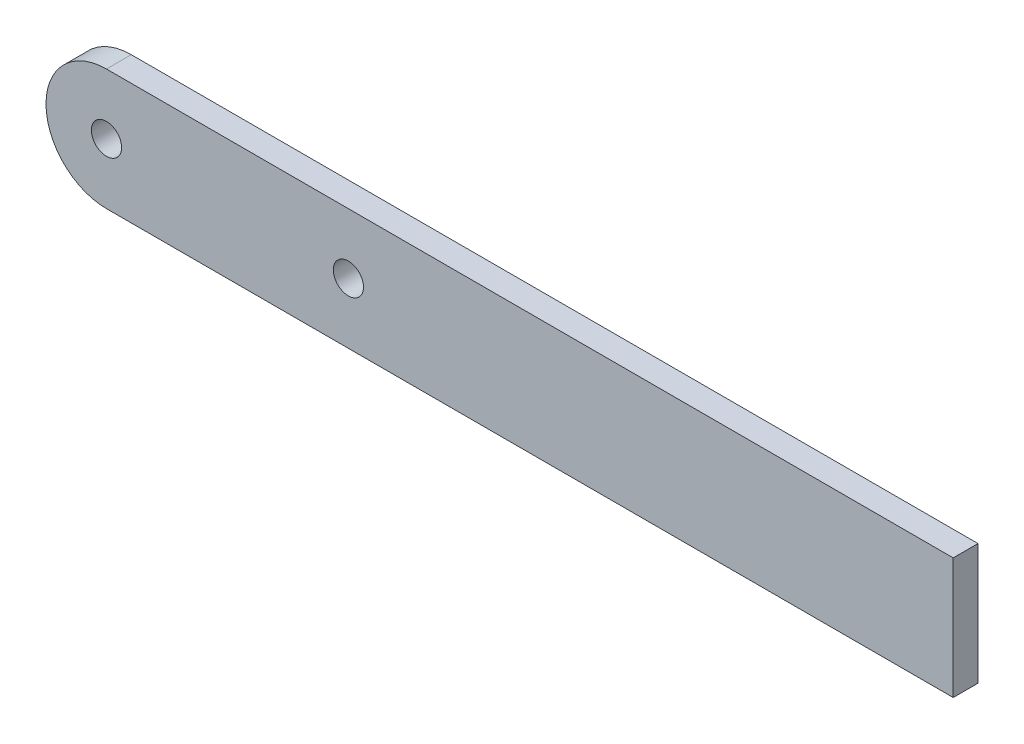
ISO-10303-21;
HEADER;
FILE_DESCRIPTION(('STEP AP214'),'2;1');
FILE_NAME('part.step','',(''),(''),'','','');
FILE_SCHEMA(('AUTOMOTIVE_DESIGN { 1 0 10303 214 1 1 1 1 }'));
ENDSEC;
DATA;
#1=APPLICATION_CONTEXT('core data for automotive mechanical design processes');
#2=APPLICATION_PROTOCOL_DEFINITION('international standard','automotive_design',2000,#1);
#3=PRODUCT_CONTEXT('',#1,'mechanical');
#4=PRODUCT('Part','Part','',(#3));
#5=PRODUCT_RELATED_PRODUCT_CATEGORY('part','',(#4));
#6=PRODUCT_DEFINITION_FORMATION('','',#4);
#7=PRODUCT_DEFINITION_CONTEXT('part definition',#1,'design');
#8=PRODUCT_DEFINITION('design','',#6,#7);
#9=PRODUCT_DEFINITION_SHAPE('','',#8);
#10=(LENGTH_UNIT() NAMED_UNIT(*) SI_UNIT(.MILLI.,.METRE.));
#11=(NAMED_UNIT(*) PLANE_ANGLE_UNIT() SI_UNIT($,.RADIAN.));
#12=(NAMED_UNIT(*) SI_UNIT($,.STERADIAN.) SOLID_ANGLE_UNIT());
#13=UNCERTAINTY_MEASURE_WITH_UNIT(LENGTH_MEASURE(1.E-05),#10,'distance_accuracy_value','');
#14=(GEOMETRIC_REPRESENTATION_CONTEXT(3) GLOBAL_UNCERTAINTY_ASSIGNED_CONTEXT((#13)) GLOBAL_UNIT_ASSIGNED_CONTEXT((#10,
#11,#12)) REPRESENTATION_CONTEXT('',''));
#15=CARTESIAN_POINT('',(0.,0.,0.));
#16=DIRECTION('',(0.,0.,1.));
#17=DIRECTION('',(1.,0.,0.));
#18=AXIS2_PLACEMENT_3D('',#15,#16,#17);
#19=CARTESIAN_POINT('',(0.,0.,5.207));
#20=DIRECTION('',(0.,1.,0.));
#21=DIRECTION('',(0.,0.,1.));
#22=AXIS2_PLACEMENT_3D('',#19,#20,#21);
#23=PLANE('',#22);
#24=DIRECTION('',(1.,0.,0.));
#25=VECTOR('',#24,1.);
#26=CARTESIAN_POINT('',(0.,0.,0.));
#27=LINE('',#26,#25);
#28=CARTESIAN_POINT('',(0.,0.,0.));
#29=VERTEX_POINT('',#28);
#30=CARTESIAN_POINT('',(177.8,0.,0.));
#31=VERTEX_POINT('',#30);
#32=EDGE_CURVE('E116',#29,#31,#27,.T.);
#33=ORIENTED_EDGE('',*,*,#32,.T.);
#34=DIRECTION('',(0.,0.,-1.));
#35=VECTOR('',#34,1.);
#36=CARTESIAN_POINT('',(177.8,0.,5.207));
#37=LINE('',#36,#35);
#38=CARTESIAN_POINT('',(177.8,0.,5.207));
#39=VERTEX_POINT('',#38);
#40=EDGE_CURVE('E11',#39,#31,#37,.T.);
#41=ORIENTED_EDGE('',*,*,#40,.F.);
#42=DIRECTION('',(1.,0.,0.));
#43=VECTOR('',#42,1.);
#44=CARTESIAN_POINT('',(0.,0.,5.207));
#45=LINE('',#44,#43);
#46=CARTESIAN_POINT('',(0.,0.,5.207));
#47=VERTEX_POINT('',#46);
#48=EDGE_CURVE('E89',#47,#39,#45,.T.);
#49=ORIENTED_EDGE('',*,*,#48,.F.);
#50=DIRECTION('',(0.,0.,-1.));
#51=VECTOR('',#50,1.);
#52=CARTESIAN_POINT('',(0.,0.,5.207));
#53=LINE('',#52,#51);
#54=EDGE_CURVE('E111',#47,#29,#53,.T.);
#55=ORIENTED_EDGE('',*,*,#54,.T.);
#56=EDGE_LOOP('',(#33,#41,#49,#55));
#57=FACE_BOUND('',#56,.T.);
#58=ADVANCED_FACE('F39',(#57),#23,.F.);
#59=CARTESIAN_POINT('',(177.8,0.,5.207));
#60=DIRECTION('',(-1.,0.,0.));
#61=DIRECTION('',(0.,0.,1.));
#62=AXIS2_PLACEMENT_3D('',#59,#60,#61);
#63=PLANE('',#62);
#64=DIRECTION('',(0.,1.,0.));
#65=VECTOR('',#64,1.);
#66=CARTESIAN_POINT('',(177.8,0.,0.));
#67=LINE('',#66,#65);
#68=CARTESIAN_POINT('',(177.8,25.4,0.));
#69=VERTEX_POINT('',#68);
#70=EDGE_CURVE('E95',#31,#69,#67,.T.);
#71=ORIENTED_EDGE('',*,*,#70,.T.);
#72=DIRECTION('',(0.,0.,-1.));
#73=VECTOR('',#72,1.);
#74=CARTESIAN_POINT('',(177.8,25.4,5.207));
#75=LINE('',#74,#73);
#76=CARTESIAN_POINT('',(177.8,25.4,5.207));
#77=VERTEX_POINT('',#76);
#78=EDGE_CURVE('E49',#77,#69,#75,.T.);
#79=ORIENTED_EDGE('',*,*,#78,.F.);
#80=DIRECTION('',(0.,1.,0.));
#81=VECTOR('',#80,1.);
#82=CARTESIAN_POINT('',(177.8,0.,5.207));
#83=LINE('',#82,#81);
#84=EDGE_CURVE('E83',#39,#77,#83,.T.);
#85=ORIENTED_EDGE('',*,*,#84,.F.);
#86=ORIENTED_EDGE('',*,*,#40,.T.);
#87=EDGE_LOOP('',(#71,#79,#85,#86));
#88=FACE_BOUND('',#87,.T.);
#89=ADVANCED_FACE('F94',(#88),#63,.F.);
#90=CARTESIAN_POINT('',(0.,25.4,5.207));
#91=DIRECTION('',(0.,1.,0.));
#92=DIRECTION('',(0.,0.,1.));
#93=AXIS2_PLACEMENT_3D('',#90,#91,#92);
#94=PLANE('',#93);
#95=DIRECTION('',(1.,0.,0.));
#96=VECTOR('',#95,1.);
#97=CARTESIAN_POINT('',(0.,25.4,0.));
#98=LINE('',#97,#96);
#99=CARTESIAN_POINT('',(0.,25.4,0.));
#100=VERTEX_POINT('',#99);
#101=EDGE_CURVE('E122',#100,#69,#98,.T.);
#102=ORIENTED_EDGE('',*,*,#101,.F.);
#103=DIRECTION('',(0.,0.,-1.));
#104=VECTOR('',#103,1.);
#105=CARTESIAN_POINT('',(0.,25.4,5.207));
#106=LINE('',#105,#104);
#107=CARTESIAN_POINT('',(0.,25.4,5.207));
#108=VERTEX_POINT('',#107);
#109=EDGE_CURVE('E73',#108,#100,#106,.T.);
#110=ORIENTED_EDGE('',*,*,#109,.F.);
#111=DIRECTION('',(1.,0.,0.));
#112=VECTOR('',#111,1.);
#113=CARTESIAN_POINT('',(0.,25.4,5.207));
#114=LINE('',#113,#112);
#115=EDGE_CURVE('E87',#108,#77,#114,.T.);
#116=ORIENTED_EDGE('',*,*,#115,.T.);
#117=ORIENTED_EDGE('',*,*,#78,.T.);
#118=EDGE_LOOP('',(#102,#110,#116,#117));
#119=FACE_BOUND('',#118,.T.);
#120=ADVANCED_FACE('F100',(#119),#94,.T.);
#121=CARTESIAN_POINT('',(0.,12.7,5.207));
#122=DIRECTION('',(0.,0.,-1.));
#123=DIRECTION('',(-1.,0.,0.));
#124=AXIS2_PLACEMENT_3D('',#121,#122,#123);
#125=CYLINDRICAL_SURFACE('',#124,12.7);
#126=CARTESIAN_POINT('',(0.,12.7,0.));
#127=DIRECTION('',(0.,0.,1.));
#128=DIRECTION('',(1.,0.,0.));
#129=AXIS2_PLACEMENT_3D('',#126,#127,#128);
#130=CIRCLE('',#129,12.7);
#131=EDGE_CURVE('E76',#100,#29,#130,.T.);
#132=ORIENTED_EDGE('',*,*,#131,.T.);
#133=ORIENTED_EDGE('',*,*,#54,.F.);
#134=CARTESIAN_POINT('',(0.,12.7,5.207));
#135=DIRECTION('',(0.,0.,1.));
#136=DIRECTION('',(1.,0.,0.));
#137=AXIS2_PLACEMENT_3D('',#134,#135,#136);
#138=CIRCLE('',#137,12.7);
#139=EDGE_CURVE('E57',#108,#47,#138,.T.);
#140=ORIENTED_EDGE('',*,*,#139,.F.);
#141=ORIENTED_EDGE('',*,*,#109,.T.);
#142=EDGE_LOOP('',(#132,#133,#140,#141));
#143=FACE_BOUND('',#142,.T.);
#144=ADVANCED_FACE('F155',(#143),#125,.T.);
#145=CARTESIAN_POINT('',(0.,12.7,5.207));
#146=DIRECTION('',(0.,0.,-1.));
#147=DIRECTION('',(-1.,0.,0.));
#148=AXIS2_PLACEMENT_3D('',#145,#146,#147);
#149=CYLINDRICAL_SURFACE('',#148,3.175);
#150=CARTESIAN_POINT('',(0.,12.7,5.207));
#151=DIRECTION('',(0.,0.,1.));
#152=DIRECTION('',(1.,0.,0.));
#153=AXIS2_PLACEMENT_3D('',#150,#151,#152);
#154=CIRCLE('',#153,3.175);
#155=CARTESIAN_POINT('',(3.175,12.7,5.207));
#156=VERTEX_POINT('',#155);
#157=EDGE_CURVE('E131',#156,#156,#154,.T.);
#158=ORIENTED_EDGE('',*,*,#157,.T.);
#159=EDGE_LOOP('',(#158));
#160=FACE_BOUND('',#159,.T.);
#161=CARTESIAN_POINT('',(0.,12.7,0.));
#162=DIRECTION('',(0.,0.,1.));
#163=DIRECTION('',(1.,0.,0.));
#164=AXIS2_PLACEMENT_3D('',#161,#162,#163);
#165=CIRCLE('',#164,3.175);
#166=CARTESIAN_POINT('',(3.175,12.7,0.));
#167=VERTEX_POINT('',#166);
#168=EDGE_CURVE('E112',#167,#167,#165,.T.);
#169=ORIENTED_EDGE('',*,*,#168,.F.);
#170=EDGE_LOOP('',(#169));
#171=FACE_BOUND('',#170,.T.);
#172=ADVANCED_FACE('F41',(#160,#171),#149,.F.);
#173=CARTESIAN_POINT('',(50.8,12.7,5.207));
#174=DIRECTION('',(0.,0.,-1.));
#175=DIRECTION('',(-1.,0.,0.));
#176=AXIS2_PLACEMENT_3D('',#173,#174,#175);
#177=CYLINDRICAL_SURFACE('',#176,3.175);
#178=CARTESIAN_POINT('',(50.8,12.7,5.207));
#179=DIRECTION('',(0.,0.,1.));
#180=DIRECTION('',(1.,0.,0.));
#181=AXIS2_PLACEMENT_3D('',#178,#179,#180);
#182=CIRCLE('',#181,3.175);
#183=CARTESIAN_POINT('',(53.975,12.7,5.207));
#184=VERTEX_POINT('',#183);
#185=EDGE_CURVE('E104',#184,#184,#182,.T.);
#186=ORIENTED_EDGE('',*,*,#185,.T.);
#187=EDGE_LOOP('',(#186));
#188=FACE_BOUND('',#187,.T.);
#189=CARTESIAN_POINT('',(50.8,12.7,0.));
#190=DIRECTION('',(0.,0.,1.));
#191=DIRECTION('',(1.,0.,0.));
#192=AXIS2_PLACEMENT_3D('',#189,#190,#191);
#193=CIRCLE('',#192,3.175);
#194=CARTESIAN_POINT('',(53.975,12.7,0.));
#195=VERTEX_POINT('',#194);
#196=EDGE_CURVE('E127',#195,#195,#193,.T.);
#197=ORIENTED_EDGE('',*,*,#196,.F.);
#198=EDGE_LOOP('',(#197));
#199=FACE_BOUND('',#198,.T.);
#200=ADVANCED_FACE('F145',(#188,#199),#177,.F.);
#201=CARTESIAN_POINT('',(0.,0.,5.207));
#202=DIRECTION('',(0.,0.,1.));
#203=DIRECTION('',(1.,0.,0.));
#204=AXIS2_PLACEMENT_3D('',#201,#202,#203);
#205=PLANE('',#204);
#206=ORIENTED_EDGE('',*,*,#157,.F.);
#207=EDGE_LOOP('',(#206));
#208=FACE_BOUND('',#207,.T.);
#209=ORIENTED_EDGE('',*,*,#48,.T.);
#210=ORIENTED_EDGE('',*,*,#84,.T.);
#211=ORIENTED_EDGE('',*,*,#115,.F.);
#212=ORIENTED_EDGE('',*,*,#139,.T.);
#213=EDGE_LOOP('',(#209,#210,#211,#212));
#214=FACE_BOUND('',#213,.T.);
#215=ORIENTED_EDGE('',*,*,#185,.F.);
#216=EDGE_LOOP('',(#215));
#217=FACE_BOUND('',#216,.T.);
#218=ADVANCED_FACE('F84',(#208,#214,#217),#205,.T.);
#219=CARTESIAN_POINT('',(0.,0.,0.));
#220=DIRECTION('',(0.,0.,1.));
#221=DIRECTION('',(1.,0.,0.));
#222=AXIS2_PLACEMENT_3D('',#219,#220,#221);
#223=PLANE('',#222);
#224=ORIENTED_EDGE('',*,*,#168,.T.);
#225=EDGE_LOOP('',(#224));
#226=FACE_BOUND('',#225,.T.);
#227=ORIENTED_EDGE('',*,*,#32,.F.);
#228=ORIENTED_EDGE('',*,*,#131,.F.);
#229=ORIENTED_EDGE('',*,*,#101,.T.);
#230=ORIENTED_EDGE('',*,*,#70,.F.);
#231=EDGE_LOOP('',(#227,#228,#229,#230));
#232=FACE_BOUND('',#231,.T.);
#233=ORIENTED_EDGE('',*,*,#196,.T.);
#234=EDGE_LOOP('',(#233));
#235=FACE_BOUND('',#234,.T.);
#236=ADVANCED_FACE('F138',(#226,#232,#235),#223,.F.);
#237=CLOSED_SHELL('',(#58,#89,#120,#144,#172,#200,#218,#236));
#238=MANIFOLD_SOLID_BREP('B2',#237);
#239=ADVANCED_BREP_SHAPE_REPRESENTATION('',(#18,#238),#14);
#240=SHAPE_DEFINITION_REPRESENTATION(#9,#239);
ENDSEC;
END-ISO-10303-21;
